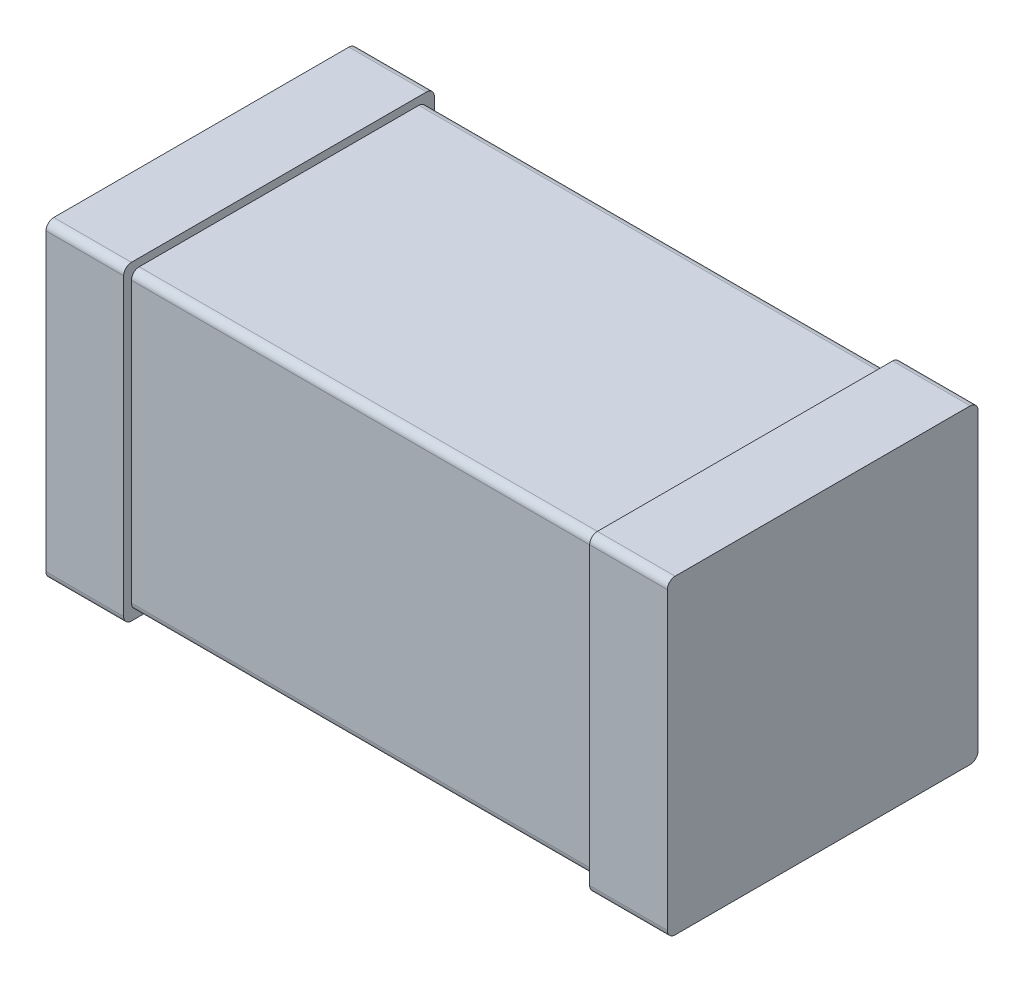
ISO-10303-21;
HEADER;
FILE_DESCRIPTION(('STEP AP214'),'2;1');
FILE_NAME('part.step','',(''),(''),'','','');
FILE_SCHEMA(('AUTOMOTIVE_DESIGN { 1 0 10303 214 1 1 1 1 }'));
ENDSEC;
DATA;
#1=APPLICATION_CONTEXT('core data for automotive mechanical design processes');
#2=APPLICATION_PROTOCOL_DEFINITION('international standard','automotive_design',2000,#1);
#3=PRODUCT_CONTEXT('',#1,'mechanical');
#4=PRODUCT('Part','Part','',(#3));
#5=PRODUCT_RELATED_PRODUCT_CATEGORY('part','',(#4));
#6=PRODUCT_DEFINITION_FORMATION('','',#4);
#7=PRODUCT_DEFINITION_CONTEXT('part definition',#1,'design');
#8=PRODUCT_DEFINITION('design','',#6,#7);
#9=PRODUCT_DEFINITION_SHAPE('','',#8);
#10=(LENGTH_UNIT() NAMED_UNIT(*) SI_UNIT(.MILLI.,.METRE.));
#11=(NAMED_UNIT(*) PLANE_ANGLE_UNIT() SI_UNIT($,.RADIAN.));
#12=(NAMED_UNIT(*) SI_UNIT($,.STERADIAN.) SOLID_ANGLE_UNIT());
#13=UNCERTAINTY_MEASURE_WITH_UNIT(LENGTH_MEASURE(1.E-05),#10,'distance_accuracy_value','');
#14=(GEOMETRIC_REPRESENTATION_CONTEXT(3) GLOBAL_UNCERTAINTY_ASSIGNED_CONTEXT((#13)) GLOBAL_UNIT_ASSIGNED_CONTEXT((#10,
#11,#12)) REPRESENTATION_CONTEXT('',''));
#15=CARTESIAN_POINT('',(0.,0.,0.));
#16=DIRECTION('',(0.,0.,1.));
#17=DIRECTION('',(1.,0.,0.));
#18=AXIS2_PLACEMENT_3D('',#15,#16,#17);
#19=CARTESIAN_POINT('',(1.6,-0.8,0.));
#20=DIRECTION('',(1.,0.,0.));
#21=DIRECTION('',(0.,1.,0.));
#22=AXIS2_PLACEMENT_3D('',#19,#20,#21);
#23=PLANE('',#22);
#24=DIRECTION('',(0.,0.,1.));
#25=VECTOR('',#24,1.);
#26=CARTESIAN_POINT('',(1.6,-0.8,0.));
#27=LINE('',#26,#25);
#28=CARTESIAN_POINT('',(1.6,-0.8,0.04));
#29=VERTEX_POINT('',#28);
#30=CARTESIAN_POINT('',(1.6,-0.8,1.56));
#31=VERTEX_POINT('',#30);
#32=EDGE_CURVE('E318',#29,#31,#27,.T.);
#33=ORIENTED_EDGE('',*,*,#32,.F.);
#34=CARTESIAN_POINT('',(1.6,-0.76,0.04));
#35=DIRECTION('',(1.,0.,0.));
#36=DIRECTION('',(0.,0.,1.));
#37=AXIS2_PLACEMENT_3D('',#34,#35,#36);
#38=CIRCLE('',#37,0.04);
#39=CARTESIAN_POINT('',(1.6,-0.76,0.));
#40=VERTEX_POINT('',#39);
#41=EDGE_CURVE('E428',#29,#40,#38,.T.);
#42=ORIENTED_EDGE('',*,*,#41,.T.);
#43=DIRECTION('',(0.,1.,0.));
#44=VECTOR('',#43,1.);
#45=CARTESIAN_POINT('',(1.6,-0.8,0.));
#46=LINE('',#45,#44);
#47=CARTESIAN_POINT('',(1.6,0.76,0.));
#48=VERTEX_POINT('',#47);
#49=EDGE_CURVE('E355',#40,#48,#46,.T.);
#50=ORIENTED_EDGE('',*,*,#49,.T.);
#51=CARTESIAN_POINT('',(1.6,0.76,0.04));
#52=DIRECTION('',(-1.,0.,0.));
#53=DIRECTION('',(0.,0.,1.));
#54=AXIS2_PLACEMENT_3D('',#51,#52,#53);
#55=CIRCLE('',#54,0.04);
#56=CARTESIAN_POINT('',(1.6,0.8,0.04));
#57=VERTEX_POINT('',#56);
#58=EDGE_CURVE('E317',#57,#48,#55,.T.);
#59=ORIENTED_EDGE('',*,*,#58,.F.);
#60=DIRECTION('',(0.,0.,1.));
#61=VECTOR('',#60,1.);
#62=CARTESIAN_POINT('',(1.6,0.8,0.));
#63=LINE('',#62,#61);
#64=CARTESIAN_POINT('',(1.6,0.8,1.56));
#65=VERTEX_POINT('',#64);
#66=EDGE_CURVE('E11',#57,#65,#63,.T.);
#67=ORIENTED_EDGE('',*,*,#66,.T.);
#68=CARTESIAN_POINT('',(1.6,0.76,1.56));
#69=DIRECTION('',(1.,0.,0.));
#70=DIRECTION('',(0.,0.,1.));
#71=AXIS2_PLACEMENT_3D('',#68,#69,#70);
#72=CIRCLE('',#71,0.04);
#73=CARTESIAN_POINT('',(1.6,0.76,1.6));
#74=VERTEX_POINT('',#73);
#75=EDGE_CURVE('E314',#65,#74,#72,.T.);
#76=ORIENTED_EDGE('',*,*,#75,.T.);
#77=DIRECTION('',(0.,1.,0.));
#78=VECTOR('',#77,1.);
#79=CARTESIAN_POINT('',(1.6,-0.8,1.6));
#80=LINE('',#79,#78);
#81=CARTESIAN_POINT('',(1.6,-0.76,1.6));
#82=VERTEX_POINT('',#81);
#83=EDGE_CURVE('E359',#82,#74,#80,.T.);
#84=ORIENTED_EDGE('',*,*,#83,.F.);
#85=CARTESIAN_POINT('',(1.6,-0.76,1.56));
#86=DIRECTION('',(-1.,0.,0.));
#87=DIRECTION('',(0.,0.,1.));
#88=AXIS2_PLACEMENT_3D('',#85,#86,#87);
#89=CIRCLE('',#88,0.04);
#90=EDGE_CURVE('E432',#31,#82,#89,.T.);
#91=ORIENTED_EDGE('',*,*,#90,.F.);
#92=EDGE_LOOP('',(#33,#42,#50,#59,#67,#76,#84,#91));
#93=FACE_BOUND('',#92,.T.);
#94=ADVANCED_FACE('F19',(#93),#23,.T.);
#95=CARTESIAN_POINT('',(1.2,0.8,0.));
#96=DIRECTION('',(0.,1.,0.));
#97=DIRECTION('',(1.,0.,0.));
#98=AXIS2_PLACEMENT_3D('',#95,#96,#97);
#99=PLANE('',#98);
#100=ORIENTED_EDGE('',*,*,#66,.F.);
#101=DIRECTION('',(1.,0.,0.));
#102=VECTOR('',#101,1.);
#103=CARTESIAN_POINT('',(1.2,0.8,0.04));
#104=LINE('',#103,#102);
#105=CARTESIAN_POINT('',(1.2,0.8,0.04));
#106=VERTEX_POINT('',#105);
#107=EDGE_CURVE('E388',#106,#57,#104,.T.);
#108=ORIENTED_EDGE('',*,*,#107,.F.);
#109=DIRECTION('',(0.,0.,1.));
#110=VECTOR('',#109,1.);
#111=CARTESIAN_POINT('',(1.2,0.8,0.));
#112=LINE('',#111,#110);
#113=CARTESIAN_POINT('',(1.2,0.8,1.56));
#114=VERTEX_POINT('',#113);
#115=EDGE_CURVE('E371',#106,#114,#112,.T.);
#116=ORIENTED_EDGE('',*,*,#115,.T.);
#117=DIRECTION('',(1.,0.,0.));
#118=VECTOR('',#117,1.);
#119=CARTESIAN_POINT('',(1.2,0.8,1.56));
#120=LINE('',#119,#118);
#121=EDGE_CURVE('E30',#114,#65,#120,.T.);
#122=ORIENTED_EDGE('',*,*,#121,.T.);
#123=EDGE_LOOP('',(#100,#108,#116,#122));
#124=FACE_BOUND('',#123,.T.);
#125=ADVANCED_FACE('F507',(#124),#99,.T.);
#126=CARTESIAN_POINT('',(1.2,0.76,1.56));
#127=DIRECTION('',(1.,0.,0.));
#128=DIRECTION('',(0.,1.,0.));
#129=AXIS2_PLACEMENT_3D('',#126,#127,#128);
#130=CYLINDRICAL_SURFACE('',#129,0.04);
#131=CARTESIAN_POINT('',(1.2,0.76,1.56));
#132=DIRECTION('',(1.,0.,0.));
#133=DIRECTION('',(0.,0.,1.));
#134=AXIS2_PLACEMENT_3D('',#131,#132,#133);
#135=CIRCLE('',#134,0.04);
#136=CARTESIAN_POINT('',(1.2,0.76,1.6));
#137=VERTEX_POINT('',#136);
#138=EDGE_CURVE('E375',#114,#137,#135,.T.);
#139=ORIENTED_EDGE('',*,*,#138,.T.);
#140=DIRECTION('',(1.,0.,0.));
#141=VECTOR('',#140,1.);
#142=CARTESIAN_POINT('',(1.2,0.76,1.6));
#143=LINE('',#142,#141);
#144=EDGE_CURVE('E392',#137,#74,#143,.T.);
#145=ORIENTED_EDGE('',*,*,#144,.T.);
#146=ORIENTED_EDGE('',*,*,#75,.F.);
#147=ORIENTED_EDGE('',*,*,#121,.F.);
#148=EDGE_LOOP('',(#139,#145,#146,#147));
#149=FACE_BOUND('',#148,.T.);
#150=ADVANCED_FACE('F502',(#149),#130,.T.);
#151=CARTESIAN_POINT('',(1.2,0.76,0.04));
#152=DIRECTION('',(1.,0.,0.));
#153=DIRECTION('',(0.,1.,0.));
#154=AXIS2_PLACEMENT_3D('',#151,#152,#153);
#155=CYLINDRICAL_SURFACE('',#154,0.04);
#156=ORIENTED_EDGE('',*,*,#107,.T.);
#157=ORIENTED_EDGE('',*,*,#58,.T.);
#158=DIRECTION('',(1.,0.,0.));
#159=VECTOR('',#158,1.);
#160=CARTESIAN_POINT('',(1.2,0.76,0.));
#161=LINE('',#160,#159);
#162=CARTESIAN_POINT('',(1.2,0.76,0.));
#163=VERTEX_POINT('',#162);
#164=EDGE_CURVE('E360',#163,#48,#161,.T.);
#165=ORIENTED_EDGE('',*,*,#164,.F.);
#166=CARTESIAN_POINT('',(1.2,0.76,0.04));
#167=DIRECTION('',(-1.,0.,0.));
#168=DIRECTION('',(0.,0.,1.));
#169=AXIS2_PLACEMENT_3D('',#166,#167,#168);
#170=CIRCLE('',#169,0.04);
#171=EDGE_CURVE('E354',#106,#163,#170,.T.);
#172=ORIENTED_EDGE('',*,*,#171,.F.);
#173=EDGE_LOOP('',(#156,#157,#165,#172));
#174=FACE_BOUND('',#173,.T.);
#175=ADVANCED_FACE('F509',(#174),#155,.T.);
#176=CARTESIAN_POINT('',(1.2,-0.8,1.6));
#177=DIRECTION('',(0.,0.,1.));
#178=DIRECTION('',(1.,0.,0.));
#179=AXIS2_PLACEMENT_3D('',#176,#177,#178);
#180=PLANE('',#179);
#181=DIRECTION('',(0.,1.,0.));
#182=VECTOR('',#181,1.);
#183=CARTESIAN_POINT('',(1.2,-0.8,1.6));
#184=LINE('',#183,#182);
#185=CARTESIAN_POINT('',(1.2,-0.76,1.6));
#186=VERTEX_POINT('',#185);
#187=EDGE_CURVE('E404',#186,#137,#184,.T.);
#188=ORIENTED_EDGE('',*,*,#187,.F.);
#189=DIRECTION('',(1.,0.,0.));
#190=VECTOR('',#189,1.);
#191=CARTESIAN_POINT('',(1.2,-0.76,1.6));
#192=LINE('',#191,#190);
#193=EDGE_CURVE('E442',#186,#82,#192,.T.);
#194=ORIENTED_EDGE('',*,*,#193,.T.);
#195=ORIENTED_EDGE('',*,*,#83,.T.);
#196=ORIENTED_EDGE('',*,*,#144,.F.);
#197=EDGE_LOOP('',(#188,#194,#195,#196));
#198=FACE_BOUND('',#197,.T.);
#199=ADVANCED_FACE('F499',(#198),#180,.T.);
#200=CARTESIAN_POINT('',(1.2,-0.8,0.));
#201=DIRECTION('',(0.,0.,1.));
#202=DIRECTION('',(1.,0.,0.));
#203=AXIS2_PLACEMENT_3D('',#200,#201,#202);
#204=PLANE('',#203);
#205=ORIENTED_EDGE('',*,*,#164,.T.);
#206=ORIENTED_EDGE('',*,*,#49,.F.);
#207=DIRECTION('',(1.,0.,0.));
#208=VECTOR('',#207,1.);
#209=CARTESIAN_POINT('',(1.2,-0.76,0.));
#210=LINE('',#209,#208);
#211=CARTESIAN_POINT('',(1.2,-0.76,0.));
#212=VERTEX_POINT('',#211);
#213=EDGE_CURVE('E322',#212,#40,#210,.T.);
#214=ORIENTED_EDGE('',*,*,#213,.F.);
#215=DIRECTION('',(0.,1.,0.));
#216=VECTOR('',#215,1.);
#217=CARTESIAN_POINT('',(1.2,-0.8,0.));
#218=LINE('',#217,#216);
#219=EDGE_CURVE('E349',#212,#163,#218,.T.);
#220=ORIENTED_EDGE('',*,*,#219,.T.);
#221=EDGE_LOOP('',(#205,#206,#214,#220));
#222=FACE_BOUND('',#221,.T.);
#223=ADVANCED_FACE('F511',(#222),#204,.F.);
#224=CARTESIAN_POINT('',(1.2,-0.76,1.56));
#225=DIRECTION('',(1.,0.,0.));
#226=DIRECTION('',(0.,-1.,0.));
#227=AXIS2_PLACEMENT_3D('',#224,#225,#226);
#228=CYLINDRICAL_SURFACE('',#227,0.04);
#229=DIRECTION('',(1.,0.,0.));
#230=VECTOR('',#229,1.);
#231=CARTESIAN_POINT('',(1.2,-0.8,1.56));
#232=LINE('',#231,#230);
#233=CARTESIAN_POINT('',(1.2,-0.8,1.56));
#234=VERTEX_POINT('',#233);
#235=EDGE_CURVE('E327',#234,#31,#232,.T.);
#236=ORIENTED_EDGE('',*,*,#235,.T.);
#237=ORIENTED_EDGE('',*,*,#90,.T.);
#238=ORIENTED_EDGE('',*,*,#193,.F.);
#239=CARTESIAN_POINT('',(1.2,-0.76,1.56));
#240=DIRECTION('',(-1.,0.,0.));
#241=DIRECTION('',(0.,0.,1.));
#242=AXIS2_PLACEMENT_3D('',#239,#240,#241);
#243=CIRCLE('',#242,0.04);
#244=EDGE_CURVE('E293',#234,#186,#243,.T.);
#245=ORIENTED_EDGE('',*,*,#244,.F.);
#246=EDGE_LOOP('',(#236,#237,#238,#245));
#247=FACE_BOUND('',#246,.T.);
#248=ADVANCED_FACE('F493',(#247),#228,.T.);
#249=CARTESIAN_POINT('',(1.2,-0.76,0.04));
#250=DIRECTION('',(1.,0.,0.));
#251=DIRECTION('',(0.,-1.,0.));
#252=AXIS2_PLACEMENT_3D('',#249,#250,#251);
#253=CYLINDRICAL_SURFACE('',#252,0.04);
#254=CARTESIAN_POINT('',(1.2,-0.76,0.04));
#255=DIRECTION('',(1.,0.,0.));
#256=DIRECTION('',(0.,0.,1.));
#257=AXIS2_PLACEMENT_3D('',#254,#255,#256);
#258=CIRCLE('',#257,0.04);
#259=CARTESIAN_POINT('',(1.2,-0.8,0.04));
#260=VERTEX_POINT('',#259);
#261=EDGE_CURVE('E353',#260,#212,#258,.T.);
#262=ORIENTED_EDGE('',*,*,#261,.T.);
#263=ORIENTED_EDGE('',*,*,#213,.T.);
#264=ORIENTED_EDGE('',*,*,#41,.F.);
#265=DIRECTION('',(1.,0.,0.));
#266=VECTOR('',#265,1.);
#267=CARTESIAN_POINT('',(1.2,-0.8,0.04));
#268=LINE('',#267,#266);
#269=EDGE_CURVE('E323',#260,#29,#268,.T.);
#270=ORIENTED_EDGE('',*,*,#269,.F.);
#271=EDGE_LOOP('',(#262,#263,#264,#270));
#272=FACE_BOUND('',#271,.T.);
#273=ADVANCED_FACE('F514',(#272),#253,.T.);
#274=CARTESIAN_POINT('',(1.2,-0.8,0.));
#275=DIRECTION('',(0.,1.,0.));
#276=DIRECTION('',(1.,0.,0.));
#277=AXIS2_PLACEMENT_3D('',#274,#275,#276);
#278=PLANE('',#277);
#279=ORIENTED_EDGE('',*,*,#235,.F.);
#280=DIRECTION('',(0.,0.,1.));
#281=VECTOR('',#280,1.);
#282=CARTESIAN_POINT('',(1.2,-0.8,0.));
#283=LINE('',#282,#281);
#284=EDGE_CURVE('E370',#260,#234,#283,.T.);
#285=ORIENTED_EDGE('',*,*,#284,.F.);
#286=ORIENTED_EDGE('',*,*,#269,.T.);
#287=ORIENTED_EDGE('',*,*,#32,.T.);
#288=EDGE_LOOP('',(#279,#285,#286,#287));
#289=FACE_BOUND('',#288,.T.);
#290=ADVANCED_FACE('F517',(#289),#278,.F.);
#291=CARTESIAN_POINT('',(1.2,-0.8,0.));
#292=DIRECTION('',(1.,0.,0.));
#293=DIRECTION('',(0.,1.,0.));
#294=AXIS2_PLACEMENT_3D('',#291,#292,#293);
#295=PLANE('',#294);
#296=DIRECTION('',(0.,1.,0.));
#297=VECTOR('',#296,1.);
#298=CARTESIAN_POINT('',(1.2,-0.76,0.04));
#299=LINE('',#298,#297);
#300=CARTESIAN_POINT('',(1.2,-0.72,0.04));
#301=VERTEX_POINT('',#300);
#302=CARTESIAN_POINT('',(1.2,0.72,0.04));
#303=VERTEX_POINT('',#302);
#304=EDGE_CURVE('E251',#301,#303,#299,.T.);
#305=ORIENTED_EDGE('',*,*,#304,.T.);
#306=CARTESIAN_POINT('',(1.2,0.72,0.08));
#307=DIRECTION('',(-1.,0.,0.));
#308=DIRECTION('',(0.,0.,1.));
#309=AXIS2_PLACEMENT_3D('',#306,#307,#308);
#310=CIRCLE('',#309,0.04);
#311=CARTESIAN_POINT('',(1.2,0.76,0.08));
#312=VERTEX_POINT('',#311);
#313=EDGE_CURVE('E313',#312,#303,#310,.T.);
#314=ORIENTED_EDGE('',*,*,#313,.F.);
#315=DIRECTION('',(0.,0.,1.));
#316=VECTOR('',#315,1.);
#317=CARTESIAN_POINT('',(1.2,0.76,0.04));
#318=LINE('',#317,#316);
#319=CARTESIAN_POINT('',(1.2,0.76,1.52));
#320=VERTEX_POINT('',#319);
#321=EDGE_CURVE('E286',#312,#320,#318,.T.);
#322=ORIENTED_EDGE('',*,*,#321,.T.);
#323=CARTESIAN_POINT('',(1.2,0.72,1.52));
#324=DIRECTION('',(1.,0.,0.));
#325=DIRECTION('',(0.,0.,1.));
#326=AXIS2_PLACEMENT_3D('',#323,#324,#325);
#327=CIRCLE('',#326,0.04);
#328=CARTESIAN_POINT('',(1.2,0.72,1.56));
#329=VERTEX_POINT('',#328);
#330=EDGE_CURVE('E348',#320,#329,#327,.T.);
#331=ORIENTED_EDGE('',*,*,#330,.T.);
#332=DIRECTION('',(0.,1.,0.));
#333=VECTOR('',#332,1.);
#334=CARTESIAN_POINT('',(1.2,-0.76,1.56));
#335=LINE('',#334,#333);
#336=CARTESIAN_POINT('',(1.2,-0.72,1.56));
#337=VERTEX_POINT('',#336);
#338=EDGE_CURVE('E290',#337,#329,#335,.T.);
#339=ORIENTED_EDGE('',*,*,#338,.F.);
#340=CARTESIAN_POINT('',(1.2,-0.72,1.52));
#341=DIRECTION('',(-1.,0.,0.));
#342=DIRECTION('',(0.,0.,1.));
#343=AXIS2_PLACEMENT_3D('',#340,#341,#342);
#344=CIRCLE('',#343,0.04);
#345=CARTESIAN_POINT('',(1.2,-0.76,1.52));
#346=VERTEX_POINT('',#345);
#347=EDGE_CURVE('E150',#346,#337,#344,.T.);
#348=ORIENTED_EDGE('',*,*,#347,.F.);
#349=DIRECTION('',(0.,0.,1.));
#350=VECTOR('',#349,1.);
#351=CARTESIAN_POINT('',(1.2,-0.76,0.04));
#352=LINE('',#351,#350);
#353=CARTESIAN_POINT('',(1.2,-0.76,0.08));
#354=VERTEX_POINT('',#353);
#355=EDGE_CURVE('E138',#354,#346,#352,.T.);
#356=ORIENTED_EDGE('',*,*,#355,.F.);
#357=CARTESIAN_POINT('',(1.2,-0.72,0.08));
#358=DIRECTION('',(1.,0.,0.));
#359=DIRECTION('',(0.,0.,1.));
#360=AXIS2_PLACEMENT_3D('',#357,#358,#359);
#361=CIRCLE('',#360,0.04);
#362=EDGE_CURVE('E254',#354,#301,#361,.T.);
#363=ORIENTED_EDGE('',*,*,#362,.T.);
#364=EDGE_LOOP('',(#305,#314,#322,#331,#339,#348,#356,#363));
#365=FACE_BOUND('',#364,.T.);
#366=ORIENTED_EDGE('',*,*,#244,.T.);
#367=ORIENTED_EDGE('',*,*,#187,.T.);
#368=ORIENTED_EDGE('',*,*,#138,.F.);
#369=ORIENTED_EDGE('',*,*,#115,.F.);
#370=ORIENTED_EDGE('',*,*,#171,.T.);
#371=ORIENTED_EDGE('',*,*,#219,.F.);
#372=ORIENTED_EDGE('',*,*,#261,.F.);
#373=ORIENTED_EDGE('',*,*,#284,.T.);
#374=EDGE_LOOP('',(#366,#367,#368,#369,#370,#371,#372,#373));
#375=FACE_BOUND('',#374,.T.);
#376=ADVANCED_FACE('F487',(#365,#375),#295,.F.);
#377=CARTESIAN_POINT('',(-1.2,-0.76,0.04));
#378=DIRECTION('',(0.,1.,0.));
#379=DIRECTION('',(1.,0.,0.));
#380=AXIS2_PLACEMENT_3D('',#377,#378,#379);
#381=PLANE('',#380);
#382=DIRECTION('',(1.,0.,0.));
#383=VECTOR('',#382,1.);
#384=CARTESIAN_POINT('',(-1.2,-0.76,1.52));
#385=LINE('',#384,#383);
#386=CARTESIAN_POINT('',(-1.2,-0.76,1.52));
#387=VERTEX_POINT('',#386);
#388=EDGE_CURVE('E287',#387,#346,#385,.T.);
#389=ORIENTED_EDGE('',*,*,#388,.F.);
#390=DIRECTION('',(0.,0.,1.));
#391=VECTOR('',#390,1.);
#392=CARTESIAN_POINT('',(-1.2,-0.76,0.04));
#393=LINE('',#392,#391);
#394=CARTESIAN_POINT('',(-1.2,-0.76,0.08));
#395=VERTEX_POINT('',#394);
#396=EDGE_CURVE('E269',#395,#387,#393,.T.);
#397=ORIENTED_EDGE('',*,*,#396,.F.);
#398=DIRECTION('',(1.,0.,0.));
#399=VECTOR('',#398,1.);
#400=CARTESIAN_POINT('',(-1.2,-0.76,0.08));
#401=LINE('',#400,#399);
#402=EDGE_CURVE('E236',#395,#354,#401,.T.);
#403=ORIENTED_EDGE('',*,*,#402,.T.);
#404=ORIENTED_EDGE('',*,*,#355,.T.);
#405=EDGE_LOOP('',(#389,#397,#403,#404));
#406=FACE_BOUND('',#405,.T.);
#407=ADVANCED_FACE('F21',(#406),#381,.F.);
#408=CARTESIAN_POINT('',(-1.2,-0.72,1.52));
#409=DIRECTION('',(1.,0.,0.));
#410=DIRECTION('',(0.,-1.,0.));
#411=AXIS2_PLACEMENT_3D('',#408,#409,#410);
#412=CYLINDRICAL_SURFACE('',#411,0.04);
#413=ORIENTED_EDGE('',*,*,#388,.T.);
#414=ORIENTED_EDGE('',*,*,#347,.T.);
#415=DIRECTION('',(1.,0.,0.));
#416=VECTOR('',#415,1.);
#417=CARTESIAN_POINT('',(-1.2,-0.72,1.56));
#418=LINE('',#417,#416);
#419=CARTESIAN_POINT('',(-1.2,-0.72,1.56));
#420=VERTEX_POINT('',#419);
#421=EDGE_CURVE('E330',#420,#337,#418,.T.);
#422=ORIENTED_EDGE('',*,*,#421,.F.);
#423=CARTESIAN_POINT('',(-1.2,-0.72,1.52));
#424=DIRECTION('',(-1.,0.,0.));
#425=DIRECTION('',(0.,0.,1.));
#426=AXIS2_PLACEMENT_3D('',#423,#424,#425);
#427=CIRCLE('',#426,0.04);
#428=EDGE_CURVE('E276',#387,#420,#427,.T.);
#429=ORIENTED_EDGE('',*,*,#428,.F.);
#430=EDGE_LOOP('',(#413,#414,#422,#429));
#431=FACE_BOUND('',#430,.T.);
#432=ADVANCED_FACE('F598',(#431),#412,.T.);
#433=CARTESIAN_POINT('',(-1.2,-0.76,1.56));
#434=DIRECTION('',(0.,0.,1.));
#435=DIRECTION('',(1.,0.,0.));
#436=AXIS2_PLACEMENT_3D('',#433,#434,#435);
#437=PLANE('',#436);
#438=DIRECTION('',(0.,1.,0.));
#439=VECTOR('',#438,1.);
#440=CARTESIAN_POINT('',(-1.2,-0.76,1.56));
#441=LINE('',#440,#439);
#442=CARTESIAN_POINT('',(-1.2,0.72,1.56));
#443=VERTEX_POINT('',#442);
#444=EDGE_CURVE('E533',#420,#443,#441,.T.);
#445=ORIENTED_EDGE('',*,*,#444,.F.);
#446=ORIENTED_EDGE('',*,*,#421,.T.);
#447=ORIENTED_EDGE('',*,*,#338,.T.);
#448=DIRECTION('',(1.,0.,0.));
#449=VECTOR('',#448,1.);
#450=CARTESIAN_POINT('',(-1.2,0.72,1.56));
#451=LINE('',#450,#449);
#452=EDGE_CURVE('E285',#443,#329,#451,.T.);
#453=ORIENTED_EDGE('',*,*,#452,.F.);
#454=EDGE_LOOP('',(#445,#446,#447,#453));
#455=FACE_BOUND('',#454,.T.);
#456=ADVANCED_FACE('F611',(#455),#437,.T.);
#457=CARTESIAN_POINT('',(-1.2,0.72,1.52));
#458=DIRECTION('',(1.,0.,0.));
#459=DIRECTION('',(0.,1.,0.));
#460=AXIS2_PLACEMENT_3D('',#457,#458,#459);
#461=CYLINDRICAL_SURFACE('',#460,0.04);
#462=CARTESIAN_POINT('',(-1.2,0.72,1.52));
#463=DIRECTION('',(1.,0.,0.));
#464=DIRECTION('',(0.,0.,1.));
#465=AXIS2_PLACEMENT_3D('',#462,#463,#464);
#466=CIRCLE('',#465,0.04);
#467=CARTESIAN_POINT('',(-1.2,0.76,1.52));
#468=VERTEX_POINT('',#467);
#469=EDGE_CURVE('E23',#468,#443,#466,.T.);
#470=ORIENTED_EDGE('',*,*,#469,.T.);
#471=ORIENTED_EDGE('',*,*,#452,.T.);
#472=ORIENTED_EDGE('',*,*,#330,.F.);
#473=DIRECTION('',(1.,0.,0.));
#474=VECTOR('',#473,1.);
#475=CARTESIAN_POINT('',(-1.2,0.76,1.52));
#476=LINE('',#475,#474);
#477=EDGE_CURVE('E282',#468,#320,#476,.T.);
#478=ORIENTED_EDGE('',*,*,#477,.F.);
#479=EDGE_LOOP('',(#470,#471,#472,#478));
#480=FACE_BOUND('',#479,.T.);
#481=ADVANCED_FACE('F608',(#480),#461,.T.);
#482=CARTESIAN_POINT('',(-1.2,0.76,0.04));
#483=DIRECTION('',(0.,1.,0.));
#484=DIRECTION('',(1.,0.,0.));
#485=AXIS2_PLACEMENT_3D('',#482,#483,#484);
#486=PLANE('',#485);
#487=ORIENTED_EDGE('',*,*,#321,.F.);
#488=DIRECTION('',(1.,0.,0.));
#489=VECTOR('',#488,1.);
#490=CARTESIAN_POINT('',(-1.2,0.76,0.08));
#491=LINE('',#490,#489);
#492=CARTESIAN_POINT('',(-1.2,0.76,0.08));
#493=VERTEX_POINT('',#492);
#494=EDGE_CURVE('E309',#493,#312,#491,.T.);
#495=ORIENTED_EDGE('',*,*,#494,.F.);
#496=DIRECTION('',(0.,0.,1.));
#497=VECTOR('',#496,1.);
#498=CARTESIAN_POINT('',(-1.2,0.76,0.04));
#499=LINE('',#498,#497);
#500=EDGE_CURVE('E344',#493,#468,#499,.T.);
#501=ORIENTED_EDGE('',*,*,#500,.T.);
#502=ORIENTED_EDGE('',*,*,#477,.T.);
#503=EDGE_LOOP('',(#487,#495,#501,#502));
#504=FACE_BOUND('',#503,.T.);
#505=ADVANCED_FACE('F604',(#504),#486,.T.);
#506=CARTESIAN_POINT('',(-1.2,0.72,0.08));
#507=DIRECTION('',(1.,0.,0.));
#508=DIRECTION('',(0.,1.,0.));
#509=AXIS2_PLACEMENT_3D('',#506,#507,#508);
#510=CYLINDRICAL_SURFACE('',#509,0.04);
#511=ORIENTED_EDGE('',*,*,#494,.T.);
#512=ORIENTED_EDGE('',*,*,#313,.T.);
#513=DIRECTION('',(1.,0.,0.));
#514=VECTOR('',#513,1.);
#515=CARTESIAN_POINT('',(-1.2,0.72,0.04));
#516=LINE('',#515,#514);
#517=CARTESIAN_POINT('',(-1.2,0.72,0.04));
#518=VERTEX_POINT('',#517);
#519=EDGE_CURVE('E300',#518,#303,#516,.T.);
#520=ORIENTED_EDGE('',*,*,#519,.F.);
#521=CARTESIAN_POINT('',(-1.2,0.72,0.08));
#522=DIRECTION('',(-1.,0.,0.));
#523=DIRECTION('',(0.,0.,1.));
#524=AXIS2_PLACEMENT_3D('',#521,#522,#523);
#525=CIRCLE('',#524,0.04);
#526=EDGE_CURVE('E264',#493,#518,#525,.T.);
#527=ORIENTED_EDGE('',*,*,#526,.F.);
#528=EDGE_LOOP('',(#511,#512,#520,#527));
#529=FACE_BOUND('',#528,.T.);
#530=ADVANCED_FACE('F602',(#529),#510,.T.);
#531=CARTESIAN_POINT('',(-1.2,-0.76,0.04));
#532=DIRECTION('',(0.,0.,1.));
#533=DIRECTION('',(1.,0.,0.));
#534=AXIS2_PLACEMENT_3D('',#531,#532,#533);
#535=PLANE('',#534);
#536=ORIENTED_EDGE('',*,*,#519,.T.);
#537=ORIENTED_EDGE('',*,*,#304,.F.);
#538=DIRECTION('',(1.,0.,0.));
#539=VECTOR('',#538,1.);
#540=CARTESIAN_POINT('',(-1.2,-0.72,0.04));
#541=LINE('',#540,#539);
#542=CARTESIAN_POINT('',(-1.2,-0.72,0.04));
#543=VERTEX_POINT('',#542);
#544=EDGE_CURVE('E244',#543,#301,#541,.T.);
#545=ORIENTED_EDGE('',*,*,#544,.F.);
#546=DIRECTION('',(0.,1.,0.));
#547=VECTOR('',#546,1.);
#548=CARTESIAN_POINT('',(-1.2,-0.76,0.04));
#549=LINE('',#548,#547);
#550=EDGE_CURVE('E248',#543,#518,#549,.T.);
#551=ORIENTED_EDGE('',*,*,#550,.T.);
#552=EDGE_LOOP('',(#536,#537,#545,#551));
#553=FACE_BOUND('',#552,.T.);
#554=ADVANCED_FACE('F247',(#553),#535,.F.);
#555=CARTESIAN_POINT('',(-1.2,-0.72,0.08));
#556=DIRECTION('',(1.,0.,0.));
#557=DIRECTION('',(0.,-1.,0.));
#558=AXIS2_PLACEMENT_3D('',#555,#556,#557);
#559=CYLINDRICAL_SURFACE('',#558,0.04);
#560=CARTESIAN_POINT('',(-1.2,-0.72,0.08));
#561=DIRECTION('',(1.,0.,0.));
#562=DIRECTION('',(0.,0.,1.));
#563=AXIS2_PLACEMENT_3D('',#560,#561,#562);
#564=CIRCLE('',#563,0.04);
#565=EDGE_CURVE('E261',#395,#543,#564,.T.);
#566=ORIENTED_EDGE('',*,*,#565,.T.);
#567=ORIENTED_EDGE('',*,*,#544,.T.);
#568=ORIENTED_EDGE('',*,*,#362,.F.);
#569=ORIENTED_EDGE('',*,*,#402,.F.);
#570=EDGE_LOOP('',(#566,#567,#568,#569));
#571=FACE_BOUND('',#570,.T.);
#572=ADVANCED_FACE('F267',(#571),#559,.T.);
#573=CARTESIAN_POINT('',(-1.2,-0.8,0.));
#574=DIRECTION('',(1.,0.,0.));
#575=DIRECTION('',(0.,1.,0.));
#576=AXIS2_PLACEMENT_3D('',#573,#574,#575);
#577=PLANE('',#576);
#578=ORIENTED_EDGE('',*,*,#565,.F.);
#579=ORIENTED_EDGE('',*,*,#396,.T.);
#580=ORIENTED_EDGE('',*,*,#428,.T.);
#581=ORIENTED_EDGE('',*,*,#444,.T.);
#582=ORIENTED_EDGE('',*,*,#469,.F.);
#583=ORIENTED_EDGE('',*,*,#500,.F.);
#584=ORIENTED_EDGE('',*,*,#526,.T.);
#585=ORIENTED_EDGE('',*,*,#550,.F.);
#586=EDGE_LOOP('',(#578,#579,#580,#581,#582,#583,#584,#585));
#587=FACE_BOUND('',#586,.T.);
#588=DIRECTION('',(0.,0.,1.));
#589=VECTOR('',#588,1.);
#590=CARTESIAN_POINT('',(-1.2,-0.8,0.));
#591=LINE('',#590,#589);
#592=CARTESIAN_POINT('',(-1.2,-0.8,0.04));
#593=VERTEX_POINT('',#592);
#594=CARTESIAN_POINT('',(-1.2,-0.8,1.56));
#595=VERTEX_POINT('',#594);
#596=EDGE_CURVE('E380',#593,#595,#591,.T.);
#597=ORIENTED_EDGE('',*,*,#596,.F.);
#598=CARTESIAN_POINT('',(-1.2,-0.76,0.04));
#599=DIRECTION('',(1.,0.,0.));
#600=DIRECTION('',(0.,0.,1.));
#601=AXIS2_PLACEMENT_3D('',#598,#599,#600);
#602=CIRCLE('',#601,0.04);
#603=CARTESIAN_POINT('',(-1.2,-0.76,0.));
#604=VERTEX_POINT('',#603);
#605=EDGE_CURVE('E294',#593,#604,#602,.T.);
#606=ORIENTED_EDGE('',*,*,#605,.T.);
#607=DIRECTION('',(0.,1.,0.));
#608=VECTOR('',#607,1.);
#609=CARTESIAN_POINT('',(-1.2,-0.8,0.));
#610=LINE('',#609,#608);
#611=CARTESIAN_POINT('',(-1.2,0.76,0.));
#612=VERTEX_POINT('',#611);
#613=EDGE_CURVE('E335',#604,#612,#610,.T.);
#614=ORIENTED_EDGE('',*,*,#613,.T.);
#615=CARTESIAN_POINT('',(-1.2,0.76,0.04));
#616=DIRECTION('',(-1.,0.,0.));
#617=DIRECTION('',(0.,0.,1.));
#618=AXIS2_PLACEMENT_3D('',#615,#616,#617);
#619=CIRCLE('',#618,0.04);
#620=CARTESIAN_POINT('',(-1.2,0.8,0.04));
#621=VERTEX_POINT('',#620);
#622=EDGE_CURVE('E443',#621,#612,#619,.T.);
#623=ORIENTED_EDGE('',*,*,#622,.F.);
#624=DIRECTION('',(0.,0.,1.));
#625=VECTOR('',#624,1.);
#626=CARTESIAN_POINT('',(-1.2,0.8,0.));
#627=LINE('',#626,#625);
#628=CARTESIAN_POINT('',(-1.2,0.8,1.56));
#629=VERTEX_POINT('',#628);
#630=EDGE_CURVE('E270',#621,#629,#627,.T.);
#631=ORIENTED_EDGE('',*,*,#630,.T.);
#632=CARTESIAN_POINT('',(-1.2,0.76,1.56));
#633=DIRECTION('',(1.,0.,0.));
#634=DIRECTION('',(0.,0.,1.));
#635=AXIS2_PLACEMENT_3D('',#632,#633,#634);
#636=CIRCLE('',#635,0.04);
#637=CARTESIAN_POINT('',(-1.2,0.76,1.6));
#638=VERTEX_POINT('',#637);
#639=EDGE_CURVE('E446',#629,#638,#636,.T.);
#640=ORIENTED_EDGE('',*,*,#639,.T.);
#641=DIRECTION('',(0.,1.,0.));
#642=VECTOR('',#641,1.);
#643=CARTESIAN_POINT('',(-1.2,-0.8,1.6));
#644=LINE('',#643,#642);
#645=CARTESIAN_POINT('',(-1.2,-0.76,1.6));
#646=VERTEX_POINT('',#645);
#647=EDGE_CURVE('E401',#646,#638,#644,.T.);
#648=ORIENTED_EDGE('',*,*,#647,.F.);
#649=CARTESIAN_POINT('',(-1.2,-0.76,1.56));
#650=DIRECTION('',(-1.,0.,0.));
#651=DIRECTION('',(0.,0.,1.));
#652=AXIS2_PLACEMENT_3D('',#649,#650,#651);
#653=CIRCLE('',#652,0.04);
#654=EDGE_CURVE('E298',#595,#646,#653,.T.);
#655=ORIENTED_EDGE('',*,*,#654,.F.);
#656=EDGE_LOOP('',(#597,#606,#614,#623,#631,#640,#648,#655));
#657=FACE_BOUND('',#656,.T.);
#658=ADVANCED_FACE('F258',(#587,#657),#577,.T.);
#659=CARTESIAN_POINT('',(-1.6,0.8,0.));
#660=DIRECTION('',(0.,1.,0.));
#661=DIRECTION('',(1.,0.,0.));
#662=AXIS2_PLACEMENT_3D('',#659,#660,#661);
#663=PLANE('',#662);
#664=ORIENTED_EDGE('',*,*,#630,.F.);
#665=DIRECTION('',(1.,0.,0.));
#666=VECTOR('',#665,1.);
#667=CARTESIAN_POINT('',(-1.6,0.8,0.04));
#668=LINE('',#667,#666);
#669=CARTESIAN_POINT('',(-1.6,0.8,0.04));
#670=VERTEX_POINT('',#669);
#671=EDGE_CURVE('E400',#670,#621,#668,.T.);
#672=ORIENTED_EDGE('',*,*,#671,.F.);
#673=DIRECTION('',(0.,0.,1.));
#674=VECTOR('',#673,1.);
#675=CARTESIAN_POINT('',(-1.6,0.8,0.));
#676=LINE('',#675,#674);
#677=CARTESIAN_POINT('',(-1.6,0.8,1.56));
#678=VERTEX_POINT('',#677);
#679=EDGE_CURVE('E341',#670,#678,#676,.T.);
#680=ORIENTED_EDGE('',*,*,#679,.T.);
#681=DIRECTION('',(1.,0.,0.));
#682=VECTOR('',#681,1.);
#683=CARTESIAN_POINT('',(-1.6,0.8,1.56));
#684=LINE('',#683,#682);
#685=EDGE_CURVE('E278',#678,#629,#684,.T.);
#686=ORIENTED_EDGE('',*,*,#685,.T.);
#687=EDGE_LOOP('',(#664,#672,#680,#686));
#688=FACE_BOUND('',#687,.T.);
#689=ADVANCED_FACE('F573',(#688),#663,.T.);
#690=CARTESIAN_POINT('',(-1.6,0.76,1.56));
#691=DIRECTION('',(1.,0.,0.));
#692=DIRECTION('',(0.,1.,0.));
#693=AXIS2_PLACEMENT_3D('',#690,#691,#692);
#694=CYLINDRICAL_SURFACE('',#693,0.04);
#695=CARTESIAN_POINT('',(-1.6,0.76,1.56));
#696=DIRECTION('',(1.,0.,0.));
#697=DIRECTION('',(0.,0.,1.));
#698=AXIS2_PLACEMENT_3D('',#695,#696,#697);
#699=CIRCLE('',#698,0.04);
#700=CARTESIAN_POINT('',(-1.6,0.76,1.6));
#701=VERTEX_POINT('',#700);
#702=EDGE_CURVE('E418',#678,#701,#699,.T.);
#703=ORIENTED_EDGE('',*,*,#702,.T.);
#704=DIRECTION('',(1.,0.,0.));
#705=VECTOR('',#704,1.);
#706=CARTESIAN_POINT('',(-1.6,0.76,1.6));
#707=LINE('',#706,#705);
#708=EDGE_CURVE('E396',#701,#638,#707,.T.);
#709=ORIENTED_EDGE('',*,*,#708,.T.);
#710=ORIENTED_EDGE('',*,*,#639,.F.);
#711=ORIENTED_EDGE('',*,*,#685,.F.);
#712=EDGE_LOOP('',(#703,#709,#710,#711));
#713=FACE_BOUND('',#712,.T.);
#714=ADVANCED_FACE('F551',(#713),#694,.T.);
#715=CARTESIAN_POINT('',(-1.6,0.76,0.04));
#716=DIRECTION('',(1.,0.,0.));
#717=DIRECTION('',(0.,1.,0.));
#718=AXIS2_PLACEMENT_3D('',#715,#716,#717);
#719=CYLINDRICAL_SURFACE('',#718,0.04);
#720=ORIENTED_EDGE('',*,*,#671,.T.);
#721=ORIENTED_EDGE('',*,*,#622,.T.);
#722=DIRECTION('',(1.,0.,0.));
#723=VECTOR('',#722,1.);
#724=CARTESIAN_POINT('',(-1.6,0.76,0.));
#725=LINE('',#724,#723);
#726=CARTESIAN_POINT('',(-1.6,0.76,0.));
#727=VERTEX_POINT('',#726);
#728=EDGE_CURVE('E331',#727,#612,#725,.T.);
#729=ORIENTED_EDGE('',*,*,#728,.F.);
#730=CARTESIAN_POINT('',(-1.6,0.76,0.04));
#731=DIRECTION('',(-1.,0.,0.));
#732=DIRECTION('',(0.,0.,1.));
#733=AXIS2_PLACEMENT_3D('',#730,#731,#732);
#734=CIRCLE('',#733,0.04);
#735=EDGE_CURVE('E337',#670,#727,#734,.T.);
#736=ORIENTED_EDGE('',*,*,#735,.F.);
#737=EDGE_LOOP('',(#720,#721,#729,#736));
#738=FACE_BOUND('',#737,.T.);
#739=ADVANCED_FACE('F570',(#738),#719,.T.);
#740=CARTESIAN_POINT('',(-1.6,-0.8,1.6));
#741=DIRECTION('',(0.,0.,1.));
#742=DIRECTION('',(1.,0.,0.));
#743=AXIS2_PLACEMENT_3D('',#740,#741,#742);
#744=PLANE('',#743);
#745=DIRECTION('',(0.,1.,0.));
#746=VECTOR('',#745,1.);
#747=CARTESIAN_POINT('',(-1.6,-0.8,1.6));
#748=LINE('',#747,#746);
#749=CARTESIAN_POINT('',(-1.6,-0.76,1.6));
#750=VERTEX_POINT('',#749);
#751=EDGE_CURVE('E415',#750,#701,#748,.T.);
#752=ORIENTED_EDGE('',*,*,#751,.F.);
#753=DIRECTION('',(1.,0.,0.));
#754=VECTOR('',#753,1.);
#755=CARTESIAN_POINT('',(-1.6,-0.76,1.6));
#756=LINE('',#755,#754);
#757=EDGE_CURVE('E336',#750,#646,#756,.T.);
#758=ORIENTED_EDGE('',*,*,#757,.T.);
#759=ORIENTED_EDGE('',*,*,#647,.T.);
#760=ORIENTED_EDGE('',*,*,#708,.F.);
#761=EDGE_LOOP('',(#752,#758,#759,#760));
#762=FACE_BOUND('',#761,.T.);
#763=ADVANCED_FACE('F555',(#762),#744,.T.);
#764=CARTESIAN_POINT('',(-1.6,-0.8,0.));
#765=DIRECTION('',(0.,0.,1.));
#766=DIRECTION('',(1.,0.,0.));
#767=AXIS2_PLACEMENT_3D('',#764,#765,#766);
#768=PLANE('',#767);
#769=ORIENTED_EDGE('',*,*,#728,.T.);
#770=ORIENTED_EDGE('',*,*,#613,.F.);
#771=DIRECTION('',(1.,0.,0.));
#772=VECTOR('',#771,1.);
#773=CARTESIAN_POINT('',(-1.6,-0.76,0.));
#774=LINE('',#773,#772);
#775=CARTESIAN_POINT('',(-1.6,-0.76,0.));
#776=VERTEX_POINT('',#775);
#777=EDGE_CURVE('E299',#776,#604,#774,.T.);
#778=ORIENTED_EDGE('',*,*,#777,.F.);
#779=DIRECTION('',(0.,1.,0.));
#780=VECTOR('',#779,1.);
#781=CARTESIAN_POINT('',(-1.6,-0.8,0.));
#782=LINE('',#781,#780);
#783=EDGE_CURVE('E308',#776,#727,#782,.T.);
#784=ORIENTED_EDGE('',*,*,#783,.T.);
#785=EDGE_LOOP('',(#769,#770,#778,#784));
#786=FACE_BOUND('',#785,.T.);
#787=ADVANCED_FACE('F567',(#786),#768,.F.);
#788=CARTESIAN_POINT('',(-1.6,-0.76,1.56));
#789=DIRECTION('',(1.,0.,0.));
#790=DIRECTION('',(0.,-1.,0.));
#791=AXIS2_PLACEMENT_3D('',#788,#789,#790);
#792=CYLINDRICAL_SURFACE('',#791,0.04);
#793=DIRECTION('',(1.,0.,0.));
#794=VECTOR('',#793,1.);
#795=CARTESIAN_POINT('',(-1.6,-0.8,1.56));
#796=LINE('',#795,#794);
#797=CARTESIAN_POINT('',(-1.6,-0.8,1.56));
#798=VERTEX_POINT('',#797);
#799=EDGE_CURVE('E379',#798,#595,#796,.T.);
#800=ORIENTED_EDGE('',*,*,#799,.T.);
#801=ORIENTED_EDGE('',*,*,#654,.T.);
#802=ORIENTED_EDGE('',*,*,#757,.F.);
#803=CARTESIAN_POINT('',(-1.6,-0.76,1.56));
#804=DIRECTION('',(-1.,0.,0.));
#805=DIRECTION('',(0.,0.,1.));
#806=AXIS2_PLACEMENT_3D('',#803,#804,#805);
#807=CIRCLE('',#806,0.04);
#808=EDGE_CURVE('E419',#798,#750,#807,.T.);
#809=ORIENTED_EDGE('',*,*,#808,.F.);
#810=EDGE_LOOP('',(#800,#801,#802,#809));
#811=FACE_BOUND('',#810,.T.);
#812=ADVANCED_FACE('F558',(#811),#792,.T.);
#813=CARTESIAN_POINT('',(-1.6,-0.76,0.04));
#814=DIRECTION('',(1.,0.,0.));
#815=DIRECTION('',(0.,-1.,0.));
#816=AXIS2_PLACEMENT_3D('',#813,#814,#815);
#817=CYLINDRICAL_SURFACE('',#816,0.04);
#818=CARTESIAN_POINT('',(-1.6,-0.76,0.04));
#819=DIRECTION('',(1.,0.,0.));
#820=DIRECTION('',(0.,0.,1.));
#821=AXIS2_PLACEMENT_3D('',#818,#819,#820);
#822=CIRCLE('',#821,0.04);
#823=CARTESIAN_POINT('',(-1.6,-0.8,0.04));
#824=VERTEX_POINT('',#823);
#825=EDGE_CURVE('E303',#824,#776,#822,.T.);
#826=ORIENTED_EDGE('',*,*,#825,.T.);
#827=ORIENTED_EDGE('',*,*,#777,.T.);
#828=ORIENTED_EDGE('',*,*,#605,.F.);
#829=DIRECTION('',(1.,0.,0.));
#830=VECTOR('',#829,1.);
#831=CARTESIAN_POINT('',(-1.6,-0.8,0.04));
#832=LINE('',#831,#830);
#833=EDGE_CURVE('E384',#824,#593,#832,.T.);
#834=ORIENTED_EDGE('',*,*,#833,.F.);
#835=EDGE_LOOP('',(#826,#827,#828,#834));
#836=FACE_BOUND('',#835,.T.);
#837=ADVANCED_FACE('F564',(#836),#817,.T.);
#838=CARTESIAN_POINT('',(-1.6,-0.8,0.));
#839=DIRECTION('',(0.,1.,0.));
#840=DIRECTION('',(1.,0.,0.));
#841=AXIS2_PLACEMENT_3D('',#838,#839,#840);
#842=PLANE('',#841);
#843=ORIENTED_EDGE('',*,*,#799,.F.);
#844=DIRECTION('',(0.,0.,1.));
#845=VECTOR('',#844,1.);
#846=CARTESIAN_POINT('',(-1.6,-0.8,0.));
#847=LINE('',#846,#845);
#848=EDGE_CURVE('E307',#824,#798,#847,.T.);
#849=ORIENTED_EDGE('',*,*,#848,.F.);
#850=ORIENTED_EDGE('',*,*,#833,.T.);
#851=ORIENTED_EDGE('',*,*,#596,.T.);
#852=EDGE_LOOP('',(#843,#849,#850,#851));
#853=FACE_BOUND('',#852,.T.);
#854=ADVANCED_FACE('F560',(#853),#842,.F.);
#855=CARTESIAN_POINT('',(-1.6,-0.8,0.));
#856=DIRECTION('',(1.,0.,0.));
#857=DIRECTION('',(0.,1.,0.));
#858=AXIS2_PLACEMENT_3D('',#855,#856,#857);
#859=PLANE('',#858);
#860=ORIENTED_EDGE('',*,*,#808,.T.);
#861=ORIENTED_EDGE('',*,*,#751,.T.);
#862=ORIENTED_EDGE('',*,*,#702,.F.);
#863=ORIENTED_EDGE('',*,*,#679,.F.);
#864=ORIENTED_EDGE('',*,*,#735,.T.);
#865=ORIENTED_EDGE('',*,*,#783,.F.);
#866=ORIENTED_EDGE('',*,*,#825,.F.);
#867=ORIENTED_EDGE('',*,*,#848,.T.);
#868=EDGE_LOOP('',(#860,#861,#862,#863,#864,#865,#866,#867));
#869=FACE_BOUND('',#868,.T.);
#870=ADVANCED_FACE('F575',(#869),#859,.F.);
#871=CLOSED_SHELL('',(#94,#125,#150,#175,#199,#223,#248,#273,#290,#376,#407,#432,#456,#481,#505,
#530,#554,#572,#658,#689,#714,#739,#763,#787,#812,#837,#854,#870));
#872=MANIFOLD_SOLID_BREP('B1',#871);
#873=ADVANCED_BREP_SHAPE_REPRESENTATION('',(#18,#872),#14);
#874=SHAPE_DEFINITION_REPRESENTATION(#9,#873);
ENDSEC;
END-ISO-10303-21;
